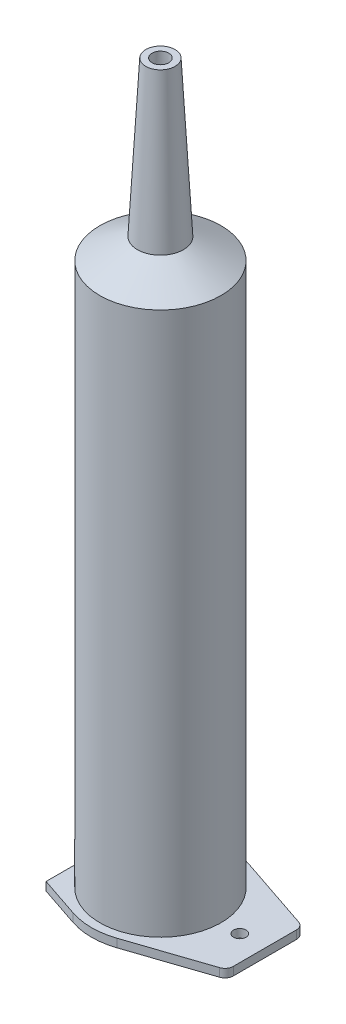
ISO-10303-21;
HEADER;
FILE_DESCRIPTION(('STEP AP214'),'2;1');
FILE_NAME('part.step','',(''),(''),'','','');
FILE_SCHEMA(('AUTOMOTIVE_DESIGN { 1 0 10303 214 1 1 1 1 }'));
ENDSEC;
DATA;
#1=APPLICATION_CONTEXT('core data for automotive mechanical design processes');
#2=APPLICATION_PROTOCOL_DEFINITION('international standard','automotive_design',2000,#1);
#3=PRODUCT_CONTEXT('',#1,'mechanical');
#4=PRODUCT('Part','Part','',(#3));
#5=PRODUCT_RELATED_PRODUCT_CATEGORY('part','',(#4));
#6=PRODUCT_DEFINITION_FORMATION('','',#4);
#7=PRODUCT_DEFINITION_CONTEXT('part definition',#1,'design');
#8=PRODUCT_DEFINITION('design','',#6,#7);
#9=PRODUCT_DEFINITION_SHAPE('','',#8);
#10=(LENGTH_UNIT() NAMED_UNIT(*) SI_UNIT(.MILLI.,.METRE.));
#11=(NAMED_UNIT(*) PLANE_ANGLE_UNIT() SI_UNIT($,.RADIAN.));
#12=(NAMED_UNIT(*) SI_UNIT($,.STERADIAN.) SOLID_ANGLE_UNIT());
#13=UNCERTAINTY_MEASURE_WITH_UNIT(LENGTH_MEASURE(1.E-05),#10,'distance_accuracy_value','');
#14=(GEOMETRIC_REPRESENTATION_CONTEXT(3) GLOBAL_UNCERTAINTY_ASSIGNED_CONTEXT((#13)) GLOBAL_UNIT_ASSIGNED_CONTEXT((#10,
#11,#12)) REPRESENTATION_CONTEXT('',''));
#15=CARTESIAN_POINT('',(0.,0.,0.));
#16=DIRECTION('',(0.,0.,1.));
#17=DIRECTION('',(1.,0.,0.));
#18=AXIS2_PLACEMENT_3D('',#15,#16,#17);
#19=CARTESIAN_POINT('',(0.,132.,0.));
#20=DIRECTION('',(0.,-1.,0.));
#21=DIRECTION('',(0.,0.,-1.));
#22=AXIS2_PLACEMENT_3D('',#19,#20,#21);
#23=CYLINDRICAL_SURFACE('',#22,14.5);
#24=CARTESIAN_POINT('',(0.,132.,0.));
#25=DIRECTION('',(0.,1.,0.));
#26=DIRECTION('',(0.,0.,1.));
#27=AXIS2_PLACEMENT_3D('',#24,#25,#26);
#28=CIRCLE('',#27,14.5);
#29=CARTESIAN_POINT('',(0.,132.,14.5));
#30=VERTEX_POINT('',#29);
#31=EDGE_CURVE('E188',#30,#30,#28,.T.);
#32=ORIENTED_EDGE('',*,*,#31,.F.);
#33=EDGE_LOOP('',(#32));
#34=FACE_BOUND('',#33,.T.);
#35=CARTESIAN_POINT('',(0.,2.,0.));
#36=DIRECTION('',(0.,-1.,0.));
#37=DIRECTION('',(0.,0.,-1.));
#38=AXIS2_PLACEMENT_3D('',#35,#36,#37);
#39=CIRCLE('',#38,14.5);
#40=CARTESIAN_POINT('',(0.,2.,-14.5));
#41=VERTEX_POINT('',#40);
#42=EDGE_CURVE('E191',#41,#41,#39,.T.);
#43=ORIENTED_EDGE('',*,*,#42,.F.);
#44=EDGE_LOOP('',(#43));
#45=FACE_BOUND('',#44,.T.);
#46=ADVANCED_FACE('F66',(#34,#45),#23,.T.);
#47=CARTESIAN_POINT('',(0.,0.,0.));
#48=DIRECTION('',(0.,1.,0.));
#49=DIRECTION('',(0.,0.,1.));
#50=AXIS2_PLACEMENT_3D('',#47,#48,#49);
#51=PLANE('',#50);
#52=CARTESIAN_POINT('',(19.,0.,0.));
#53=DIRECTION('',(0.,-1.,0.));
#54=DIRECTION('',(0.,0.,-1.));
#55=AXIS2_PLACEMENT_3D('',#52,#53,#54);
#56=CIRCLE('',#55,1.5);
#57=CARTESIAN_POINT('',(19.,0.,-1.5));
#58=VERTEX_POINT('',#57);
#59=EDGE_CURVE('E212',#58,#58,#56,.T.);
#60=ORIENTED_EDGE('',*,*,#59,.F.);
#61=EDGE_LOOP('',(#60));
#62=FACE_BOUND('',#61,.T.);
#63=CARTESIAN_POINT('',(0.,0.,0.));
#64=DIRECTION('',(0.,1.,0.));
#65=DIRECTION('',(0.,0.,1.));
#66=AXIS2_PLACEMENT_3D('',#63,#64,#65);
#67=CIRCLE('',#66,13.);
#68=CARTESIAN_POINT('',(0.,0.,13.));
#69=VERTEX_POINT('',#68);
#70=EDGE_CURVE('E178',#69,#69,#67,.T.);
#71=ORIENTED_EDGE('',*,*,#70,.T.);
#72=EDGE_LOOP('',(#71));
#73=FACE_BOUND('',#72,.T.);
#74=DIRECTION('',(-0.947828101970911,0.,-0.318781883290472));
#75=VECTOR('',#74,1.);
#76=CARTESIAN_POINT('',(-25.,0.,9.));
#77=LINE('',#76,#75);
#78=CARTESIAN_POINT('',(-5.25990107429279,0.,15.63916368252));
#79=VERTEX_POINT('',#78);
#80=CARTESIAN_POINT('',(-15.,0.,12.3632879488126));
#81=VERTEX_POINT('',#80);
#82=EDGE_CURVE('E161',#79,#81,#77,.T.);
#83=ORIENTED_EDGE('',*,*,#82,.T.);
#84=DIRECTION('',(0.,0.,1.));
#85=VECTOR('',#84,1.);
#86=CARTESIAN_POINT('',(-15.,0.,12.3632879488126));
#87=LINE('',#86,#85);
#88=CARTESIAN_POINT('',(-15.,0.,-12.3632879488126));
#89=VERTEX_POINT('',#88);
#90=EDGE_CURVE('E148',#89,#81,#87,.T.);
#91=ORIENTED_EDGE('',*,*,#90,.F.);
#92=DIRECTION('',(0.947828101970911,0.,-0.318781883290472));
#93=VECTOR('',#92,1.);
#94=CARTESIAN_POINT('',(-25.,0.,-9.));
#95=LINE('',#94,#93);
#96=CARTESIAN_POINT('',(-5.25990107429278,0.,-15.63916368252));
#97=VERTEX_POINT('',#96);
#98=EDGE_CURVE('E157',#89,#97,#95,.T.);
#99=ORIENTED_EDGE('',*,*,#98,.T.);
#100=CARTESIAN_POINT('',(0.,0.,0.));
#101=DIRECTION('',(0.,-1.,0.));
#102=DIRECTION('',(0.,0.,-1.));
#103=AXIS2_PLACEMENT_3D('',#100,#101,#102);
#104=CIRCLE('',#103,16.5);
#105=CARTESIAN_POINT('',(5.25990107429279,0.,-15.63916368252));
#106=VERTEX_POINT('',#105);
#107=EDGE_CURVE('E168',#97,#106,#104,.T.);
#108=ORIENTED_EDGE('',*,*,#107,.T.);
#109=DIRECTION('',(0.947828101970911,0.,0.318781883290472));
#110=VECTOR('',#109,1.);
#111=CARTESIAN_POINT('',(25.,0.,-9.));
#112=LINE('',#111,#110);
#113=CARTESIAN_POINT('',(23.6375637665809,0.,-9.4582265364884));
#114=VERTEX_POINT('',#113);
#115=EDGE_CURVE('E311',#106,#114,#112,.T.);
#116=ORIENTED_EDGE('',*,*,#115,.T.);
#117=CARTESIAN_POINT('',(23.,0.,-7.56257033254658));
#118=DIRECTION('',(0.,1.,0.));
#119=DIRECTION('',(0.,0.,1.));
#120=AXIS2_PLACEMENT_3D('',#117,#118,#119);
#121=CIRCLE('',#120,2.);
#122=CARTESIAN_POINT('',(25.,0.,-7.56257033254658));
#123=VERTEX_POINT('',#122);
#124=EDGE_CURVE('E194',#114,#123,#121,.F.);
#125=ORIENTED_EDGE('',*,*,#124,.T.);
#126=DIRECTION('',(0.,0.,1.));
#127=VECTOR('',#126,1.);
#128=CARTESIAN_POINT('',(25.,0.,-9.));
#129=LINE('',#128,#127);
#130=CARTESIAN_POINT('',(25.,0.,7.56257033254658));
#131=VERTEX_POINT('',#130);
#132=EDGE_CURVE('E305',#123,#131,#129,.T.);
#133=ORIENTED_EDGE('',*,*,#132,.T.);
#134=CARTESIAN_POINT('',(23.,0.,7.56257033254658));
#135=DIRECTION('',(0.,1.,0.));
#136=DIRECTION('',(0.,0.,1.));
#137=AXIS2_PLACEMENT_3D('',#134,#135,#136);
#138=CIRCLE('',#137,2.);
#139=CARTESIAN_POINT('',(23.6375637665809,0.,9.4582265364884));
#140=VERTEX_POINT('',#139);
#141=EDGE_CURVE('E196',#131,#140,#138,.F.);
#142=ORIENTED_EDGE('',*,*,#141,.T.);
#143=DIRECTION('',(-0.947828101970911,0.,0.318781883290472));
#144=VECTOR('',#143,1.);
#145=CARTESIAN_POINT('',(25.,0.,9.));
#146=LINE('',#145,#144);
#147=CARTESIAN_POINT('',(5.25990107429279,0.,15.63916368252));
#148=VERTEX_POINT('',#147);
#149=EDGE_CURVE('E310',#140,#148,#146,.T.);
#150=ORIENTED_EDGE('',*,*,#149,.T.);
#151=CARTESIAN_POINT('',(0.,0.,0.));
#152=DIRECTION('',(0.,-1.,0.));
#153=DIRECTION('',(0.,0.,-1.));
#154=AXIS2_PLACEMENT_3D('',#151,#152,#153);
#155=CIRCLE('',#154,16.5);
#156=EDGE_CURVE('E172',#148,#79,#155,.T.);
#157=ORIENTED_EDGE('',*,*,#156,.T.);
#158=EDGE_LOOP('',(#83,#91,#99,#108,#116,#125,#133,#142,#150,#157));
#159=FACE_BOUND('',#158,.T.);
#160=ADVANCED_FACE('F155',(#62,#73,#159),#51,.F.);
#161=CARTESIAN_POINT('',(0.,132.,0.));
#162=DIRECTION('',(0.,-1.,0.));
#163=DIRECTION('',(0.,0.,-1.));
#164=AXIS2_PLACEMENT_3D('',#161,#162,#163);
#165=CYLINDRICAL_SURFACE('',#164,13.);
#166=CARTESIAN_POINT('',(0.,132.,0.));
#167=DIRECTION('',(0.,-1.,0.));
#168=DIRECTION('',(0.,0.,-1.));
#169=AXIS2_PLACEMENT_3D('',#166,#167,#168);
#170=CIRCLE('',#169,13.);
#171=CARTESIAN_POINT('',(0.,132.,-13.));
#172=VERTEX_POINT('',#171);
#173=EDGE_CURVE('E343',#172,#172,#170,.T.);
#174=ORIENTED_EDGE('',*,*,#173,.F.);
#175=EDGE_LOOP('',(#174));
#176=FACE_BOUND('',#175,.T.);
#177=ORIENTED_EDGE('',*,*,#70,.F.);
#178=EDGE_LOOP('',(#177));
#179=FACE_BOUND('',#178,.T.);
#180=ADVANCED_FACE('F285',(#176,#179),#165,.F.);
#181=CARTESIAN_POINT('',(25.,2.,-9.));
#182=DIRECTION('',(0.318781883290472,0.,-0.947828101970911));
#183=DIRECTION('',(-0.947828101970911,0.,-0.318781883290472));
#184=AXIS2_PLACEMENT_3D('',#181,#182,#183);
#185=PLANE('',#184);
#186=DIRECTION('',(0.947828101970911,0.,0.318781883290472));
#187=VECTOR('',#186,1.);
#188=CARTESIAN_POINT('',(25.,2.,-9.));
#189=LINE('',#188,#187);
#190=CARTESIAN_POINT('',(5.25990107429279,2.,-15.63916368252));
#191=VERTEX_POINT('',#190);
#192=CARTESIAN_POINT('',(23.6375637665809,2.,-9.4582265364884));
#193=VERTEX_POINT('',#192);
#194=EDGE_CURVE('E170',#191,#193,#189,.T.);
#195=ORIENTED_EDGE('',*,*,#194,.T.);
#196=DIRECTION('',(0.,-1.,0.));
#197=VECTOR('',#196,1.);
#198=CARTESIAN_POINT('',(23.6375637665809,2.,-9.4582265364884));
#199=LINE('',#198,#197);
#200=EDGE_CURVE('E76',#193,#114,#199,.T.);
#201=ORIENTED_EDGE('',*,*,#200,.T.);
#202=ORIENTED_EDGE('',*,*,#115,.F.);
#203=DIRECTION('',(0.,-1.,0.));
#204=VECTOR('',#203,1.);
#205=CARTESIAN_POINT('',(5.25990107429279,2.,-15.63916368252));
#206=LINE('',#205,#204);
#207=EDGE_CURVE('E176',#191,#106,#206,.T.);
#208=ORIENTED_EDGE('',*,*,#207,.F.);
#209=EDGE_LOOP('',(#195,#201,#202,#208));
#210=FACE_BOUND('',#209,.T.);
#211=ADVANCED_FACE('F264',(#210),#185,.T.);
#212=CARTESIAN_POINT('',(0.,2.,0.));
#213=DIRECTION('',(0.,-1.,0.));
#214=DIRECTION('',(0.,0.,-1.));
#215=AXIS2_PLACEMENT_3D('',#212,#213,#214);
#216=CYLINDRICAL_SURFACE('',#215,16.5);
#217=ORIENTED_EDGE('',*,*,#107,.F.);
#218=DIRECTION('',(0.,-1.,0.));
#219=VECTOR('',#218,1.);
#220=CARTESIAN_POINT('',(-5.25990107429278,2.,-15.63916368252));
#221=LINE('',#220,#219);
#222=CARTESIAN_POINT('',(-5.25990107429278,2.,-15.63916368252));
#223=VERTEX_POINT('',#222);
#224=EDGE_CURVE('E166',#223,#97,#221,.T.);
#225=ORIENTED_EDGE('',*,*,#224,.F.);
#226=CARTESIAN_POINT('',(0.,2.,0.));
#227=DIRECTION('',(0.,-1.,0.));
#228=DIRECTION('',(0.,0.,-1.));
#229=AXIS2_PLACEMENT_3D('',#226,#227,#228);
#230=CIRCLE('',#229,16.5);
#231=EDGE_CURVE('E185',#223,#191,#230,.T.);
#232=ORIENTED_EDGE('',*,*,#231,.T.);
#233=ORIENTED_EDGE('',*,*,#207,.T.);
#234=EDGE_LOOP('',(#217,#225,#232,#233));
#235=FACE_BOUND('',#234,.T.);
#236=ADVANCED_FACE('F261',(#235),#216,.T.);
#237=CARTESIAN_POINT('',(-25.,2.,-9.));
#238=DIRECTION('',(-0.318781883290472,0.,-0.947828101970911));
#239=DIRECTION('',(-0.947828101970911,0.,0.318781883290472));
#240=AXIS2_PLACEMENT_3D('',#237,#238,#239);
#241=PLANE('',#240);
#242=DIRECTION('',(0.,-1.,0.));
#243=VECTOR('',#242,1.);
#244=CARTESIAN_POINT('',(-15.,10.,-12.3632879488126));
#245=LINE('',#244,#243);
#246=CARTESIAN_POINT('',(-15.,2.,-12.3632879488126));
#247=VERTEX_POINT('',#246);
#248=EDGE_CURVE('E145',#247,#89,#245,.T.);
#249=ORIENTED_EDGE('',*,*,#248,.F.);
#250=DIRECTION('',(0.947828101970911,0.,-0.318781883290472));
#251=VECTOR('',#250,1.);
#252=CARTESIAN_POINT('',(-25.,2.,-9.));
#253=LINE('',#252,#251);
#254=EDGE_CURVE('E334',#247,#223,#253,.T.);
#255=ORIENTED_EDGE('',*,*,#254,.T.);
#256=ORIENTED_EDGE('',*,*,#224,.T.);
#257=ORIENTED_EDGE('',*,*,#98,.F.);
#258=EDGE_LOOP('',(#249,#255,#256,#257));
#259=FACE_BOUND('',#258,.T.);
#260=ADVANCED_FACE('F164',(#259),#241,.T.);
#261=CARTESIAN_POINT('',(-25.,2.,9.));
#262=DIRECTION('',(-0.318781883290472,0.,0.947828101970911));
#263=DIRECTION('',(0.947828101970911,0.,0.318781883290472));
#264=AXIS2_PLACEMENT_3D('',#261,#262,#263);
#265=PLANE('',#264);
#266=DIRECTION('',(0.,-1.,0.));
#267=VECTOR('',#266,1.);
#268=CARTESIAN_POINT('',(-15.,10.,12.3632879488126));
#269=LINE('',#268,#267);
#270=CARTESIAN_POINT('',(-15.,2.,12.3632879488126));
#271=VERTEX_POINT('',#270);
#272=EDGE_CURVE('E84',#271,#81,#269,.T.);
#273=ORIENTED_EDGE('',*,*,#272,.T.);
#274=ORIENTED_EDGE('',*,*,#82,.F.);
#275=DIRECTION('',(0.,-1.,0.));
#276=VECTOR('',#275,1.);
#277=CARTESIAN_POINT('',(-5.25990107429279,2.,15.63916368252));
#278=LINE('',#277,#276);
#279=CARTESIAN_POINT('',(-5.25990107429279,2.,15.63916368252));
#280=VERTEX_POINT('',#279);
#281=EDGE_CURVE('E180',#280,#79,#278,.T.);
#282=ORIENTED_EDGE('',*,*,#281,.F.);
#283=DIRECTION('',(-0.947828101970911,0.,-0.318781883290472));
#284=VECTOR('',#283,1.);
#285=CARTESIAN_POINT('',(-25.,2.,9.));
#286=LINE('',#285,#284);
#287=EDGE_CURVE('E323',#280,#271,#286,.T.);
#288=ORIENTED_EDGE('',*,*,#287,.T.);
#289=EDGE_LOOP('',(#273,#274,#282,#288));
#290=FACE_BOUND('',#289,.T.);
#291=ADVANCED_FACE('F268',(#290),#265,.T.);
#292=CARTESIAN_POINT('',(0.,2.,0.));
#293=DIRECTION('',(0.,-1.,0.));
#294=DIRECTION('',(0.,0.,-1.));
#295=AXIS2_PLACEMENT_3D('',#292,#293,#294);
#296=CYLINDRICAL_SURFACE('',#295,16.5);
#297=ORIENTED_EDGE('',*,*,#156,.F.);
#298=DIRECTION('',(0.,-1.,0.));
#299=VECTOR('',#298,1.);
#300=CARTESIAN_POINT('',(5.25990107429279,2.,15.63916368252));
#301=LINE('',#300,#299);
#302=CARTESIAN_POINT('',(5.25990107429279,2.,15.63916368252));
#303=VERTEX_POINT('',#302);
#304=EDGE_CURVE('E182',#303,#148,#301,.T.);
#305=ORIENTED_EDGE('',*,*,#304,.F.);
#306=CARTESIAN_POINT('',(0.,2.,0.));
#307=DIRECTION('',(0.,-1.,0.));
#308=DIRECTION('',(0.,0.,-1.));
#309=AXIS2_PLACEMENT_3D('',#306,#307,#308);
#310=CIRCLE('',#309,16.5);
#311=EDGE_CURVE('E320',#303,#280,#310,.T.);
#312=ORIENTED_EDGE('',*,*,#311,.T.);
#313=ORIENTED_EDGE('',*,*,#281,.T.);
#314=EDGE_LOOP('',(#297,#305,#312,#313));
#315=FACE_BOUND('',#314,.T.);
#316=ADVANCED_FACE('F271',(#315),#296,.T.);
#317=CARTESIAN_POINT('',(25.,2.,9.));
#318=DIRECTION('',(0.318781883290472,0.,0.947828101970911));
#319=DIRECTION('',(0.947828101970911,0.,-0.318781883290472));
#320=AXIS2_PLACEMENT_3D('',#317,#318,#319);
#321=PLANE('',#320);
#322=ORIENTED_EDGE('',*,*,#149,.F.);
#323=DIRECTION('',(0.,-1.,0.));
#324=VECTOR('',#323,1.);
#325=CARTESIAN_POINT('',(23.6375637665809,2.,9.4582265364884));
#326=LINE('',#325,#324);
#327=CARTESIAN_POINT('',(23.6375637665809,2.,9.4582265364884));
#328=VERTEX_POINT('',#327);
#329=EDGE_CURVE('E206',#140,#328,#326,.F.);
#330=ORIENTED_EDGE('',*,*,#329,.T.);
#331=DIRECTION('',(-0.947828101970911,0.,0.318781883290472));
#332=VECTOR('',#331,1.);
#333=CARTESIAN_POINT('',(25.,2.,9.));
#334=LINE('',#333,#332);
#335=EDGE_CURVE('E330',#328,#303,#334,.T.);
#336=ORIENTED_EDGE('',*,*,#335,.T.);
#337=ORIENTED_EDGE('',*,*,#304,.T.);
#338=EDGE_LOOP('',(#322,#330,#336,#337));
#339=FACE_BOUND('',#338,.T.);
#340=ADVANCED_FACE('F275',(#339),#321,.T.);
#341=CARTESIAN_POINT('',(25.,2.,-9.));
#342=DIRECTION('',(1.,0.,0.));
#343=DIRECTION('',(0.,0.,-1.));
#344=AXIS2_PLACEMENT_3D('',#341,#342,#343);
#345=PLANE('',#344);
#346=DIRECTION('',(0.,0.,1.));
#347=VECTOR('',#346,1.);
#348=CARTESIAN_POINT('',(25.,2.,-9.));
#349=LINE('',#348,#347);
#350=CARTESIAN_POINT('',(25.,2.,-7.56257033254658));
#351=VERTEX_POINT('',#350);
#352=CARTESIAN_POINT('',(25.,2.,7.56257033254658));
#353=VERTEX_POINT('',#352);
#354=EDGE_CURVE('E307',#351,#353,#349,.T.);
#355=ORIENTED_EDGE('',*,*,#354,.T.);
#356=DIRECTION('',(0.,-1.,0.));
#357=VECTOR('',#356,1.);
#358=CARTESIAN_POINT('',(25.,2.,7.56257033254658));
#359=LINE('',#358,#357);
#360=EDGE_CURVE('E203',#353,#131,#359,.T.);
#361=ORIENTED_EDGE('',*,*,#360,.T.);
#362=ORIENTED_EDGE('',*,*,#132,.F.);
#363=DIRECTION('',(0.,-1.,0.));
#364=VECTOR('',#363,1.);
#365=CARTESIAN_POINT('',(25.,2.,-7.56257033254658));
#366=LINE('',#365,#364);
#367=EDGE_CURVE('E201',#123,#351,#366,.F.);
#368=ORIENTED_EDGE('',*,*,#367,.T.);
#369=EDGE_LOOP('',(#355,#361,#362,#368));
#370=FACE_BOUND('',#369,.T.);
#371=ADVANCED_FACE('F259',(#370),#345,.T.);
#372=CARTESIAN_POINT('',(0.,2.,0.));
#373=DIRECTION('',(0.,-1.,0.));
#374=DIRECTION('',(0.,0.,-1.));
#375=AXIS2_PLACEMENT_3D('',#372,#373,#374);
#376=PLANE('',#375);
#377=CARTESIAN_POINT('',(19.,2.,0.));
#378=DIRECTION('',(0.,-1.,0.));
#379=DIRECTION('',(0.,0.,-1.));
#380=AXIS2_PLACEMENT_3D('',#377,#378,#379);
#381=CIRCLE('',#380,1.5);
#382=CARTESIAN_POINT('',(19.,2.,-1.5));
#383=VERTEX_POINT('',#382);
#384=EDGE_CURVE('E162',#383,#383,#381,.T.);
#385=ORIENTED_EDGE('',*,*,#384,.T.);
#386=EDGE_LOOP('',(#385));
#387=FACE_BOUND('',#386,.T.);
#388=ORIENTED_EDGE('',*,*,#42,.T.);
#389=EDGE_LOOP('',(#388));
#390=FACE_BOUND('',#389,.T.);
#391=ORIENTED_EDGE('',*,*,#254,.F.);
#392=DIRECTION('',(0.,0.,1.));
#393=VECTOR('',#392,1.);
#394=CARTESIAN_POINT('',(-15.,2.,0.));
#395=LINE('',#394,#393);
#396=EDGE_CURVE('E13',#247,#271,#395,.T.);
#397=ORIENTED_EDGE('',*,*,#396,.T.);
#398=ORIENTED_EDGE('',*,*,#287,.F.);
#399=ORIENTED_EDGE('',*,*,#311,.F.);
#400=ORIENTED_EDGE('',*,*,#335,.F.);
#401=CARTESIAN_POINT('',(23.,2.,7.56257033254658));
#402=DIRECTION('',(0.,-1.,0.));
#403=DIRECTION('',(0.,0.,-1.));
#404=AXIS2_PLACEMENT_3D('',#401,#402,#403);
#405=CIRCLE('',#404,2.);
#406=EDGE_CURVE('E91',#328,#353,#405,.F.);
#407=ORIENTED_EDGE('',*,*,#406,.T.);
#408=ORIENTED_EDGE('',*,*,#354,.F.);
#409=CARTESIAN_POINT('',(23.,2.,-7.56257033254658));
#410=DIRECTION('',(0.,-1.,0.));
#411=DIRECTION('',(0.,0.,-1.));
#412=AXIS2_PLACEMENT_3D('',#409,#410,#411);
#413=CIRCLE('',#412,2.);
#414=EDGE_CURVE('E198',#351,#193,#413,.F.);
#415=ORIENTED_EDGE('',*,*,#414,.T.);
#416=ORIENTED_EDGE('',*,*,#194,.F.);
#417=ORIENTED_EDGE('',*,*,#231,.F.);
#418=EDGE_LOOP('',(#391,#397,#398,#399,#400,#407,#408,#415,#416,#417));
#419=FACE_BOUND('',#418,.T.);
#420=ADVANCED_FACE('F255',(#387,#390,#419),#376,.F.);
#421=CARTESIAN_POINT('',(23.,2.,7.56257033254658));
#422=DIRECTION('',(0.,-1.,0.));
#423=DIRECTION('',(0.,0.,-1.));
#424=AXIS2_PLACEMENT_3D('',#421,#422,#423);
#425=CYLINDRICAL_SURFACE('',#424,2.);
#426=ORIENTED_EDGE('',*,*,#406,.F.);
#427=ORIENTED_EDGE('',*,*,#329,.F.);
#428=ORIENTED_EDGE('',*,*,#141,.F.);
#429=ORIENTED_EDGE('',*,*,#360,.F.);
#430=EDGE_LOOP('',(#426,#427,#428,#429));
#431=FACE_BOUND('',#430,.T.);
#432=ADVANCED_FACE('F258',(#431),#425,.T.);
#433=CARTESIAN_POINT('',(23.,2.,-7.56257033254658));
#434=DIRECTION('',(0.,-1.,0.));
#435=DIRECTION('',(0.,0.,-1.));
#436=AXIS2_PLACEMENT_3D('',#433,#434,#435);
#437=CYLINDRICAL_SURFACE('',#436,2.);
#438=ORIENTED_EDGE('',*,*,#414,.F.);
#439=ORIENTED_EDGE('',*,*,#367,.F.);
#440=ORIENTED_EDGE('',*,*,#124,.F.);
#441=ORIENTED_EDGE('',*,*,#200,.F.);
#442=EDGE_LOOP('',(#438,#439,#440,#441));
#443=FACE_BOUND('',#442,.T.);
#444=ADVANCED_FACE('F68',(#443),#437,.T.);
#445=CARTESIAN_POINT('',(-15.,10.,12.3632879488126));
#446=DIRECTION('',(1.,0.,0.));
#447=DIRECTION('',(0.,0.,-1.));
#448=AXIS2_PLACEMENT_3D('',#445,#446,#447);
#449=PLANE('',#448);
#450=ORIENTED_EDGE('',*,*,#248,.T.);
#451=ORIENTED_EDGE('',*,*,#90,.T.);
#452=ORIENTED_EDGE('',*,*,#272,.F.);
#453=ORIENTED_EDGE('',*,*,#396,.F.);
#454=EDGE_LOOP('',(#450,#451,#452,#453));
#455=FACE_BOUND('',#454,.T.);
#456=ADVANCED_FACE('F147',(#455),#449,.F.);
#457=CARTESIAN_POINT('',(19.,10.,0.));
#458=DIRECTION('',(0.,-1.,0.));
#459=DIRECTION('',(0.,0.,-1.));
#460=AXIS2_PLACEMENT_3D('',#457,#458,#459);
#461=CYLINDRICAL_SURFACE('',#460,1.5);
#462=ORIENTED_EDGE('',*,*,#59,.T.);
#463=EDGE_LOOP('',(#462));
#464=FACE_BOUND('',#463,.T.);
#465=ORIENTED_EDGE('',*,*,#384,.F.);
#466=EDGE_LOOP('',(#465));
#467=FACE_BOUND('',#466,.T.);
#468=ADVANCED_FACE('F241',(#464,#467),#461,.F.);
#469=CARTESIAN_POINT('',(0.,132.,0.));
#470=DIRECTION('',(0.,-1.,0.));
#471=DIRECTION('',(0.,0.,-1.));
#472=AXIS2_PLACEMENT_3D('',#469,#470,#471);
#473=CONICAL_SURFACE('',#472,13.,1.06369782240256);
#474=CARTESIAN_POINT('',(0.,137.,0.));
#475=DIRECTION('',(0.,-1.,0.));
#476=DIRECTION('',(0.,0.,-1.));
#477=AXIS2_PLACEMENT_3D('',#474,#475,#476);
#478=CIRCLE('',#477,4.);
#479=CARTESIAN_POINT('',(0.,137.,-3.99999999999998));
#480=VERTEX_POINT('',#479);
#481=EDGE_CURVE('E70',#480,#480,#478,.T.);
#482=CARTESIAN_POINT('',(0.,137.,-3.99999999999998));
#483=CARTESIAN_POINT('',(0.,136.947916666667,-4.09374999999998));
#484=CARTESIAN_POINT('',(0.,136.895833333333,-4.18749999999998));
#485=CARTESIAN_POINT('',(0.,136.791666666667,-4.37499999999998));
#486=CARTESIAN_POINT('',(0.,136.739583333333,-4.46874999999998));
#487=CARTESIAN_POINT('',(0.,136.635416666667,-4.65624999999998));
#488=CARTESIAN_POINT('',(0.,136.583333333333,-4.74999999999998));
#489=CARTESIAN_POINT('',(0.,136.479166666667,-4.93749999999998));
#490=CARTESIAN_POINT('',(0.,136.427083333333,-5.03124999999998));
#491=CARTESIAN_POINT('',(0.,136.322916666667,-5.21874999999998));
#492=CARTESIAN_POINT('',(0.,136.270833333333,-5.31249999999998));
#493=CARTESIAN_POINT('',(0.,136.166666666667,-5.49999999999998));
#494=CARTESIAN_POINT('',(0.,136.114583333333,-5.59374999999998));
#495=CARTESIAN_POINT('',(0.,136.010416666667,-5.78124999999998));
#496=CARTESIAN_POINT('',(0.,135.958333333333,-5.87499999999998));
#497=CARTESIAN_POINT('',(0.,135.854166666667,-6.06249999999998));
#498=CARTESIAN_POINT('',(0.,135.802083333333,-6.15624999999998));
#499=CARTESIAN_POINT('',(0.,135.697916666667,-6.34374999999998));
#500=CARTESIAN_POINT('',(0.,135.645833333333,-6.43749999999998));
#501=CARTESIAN_POINT('',(0.,135.541666666667,-6.62499999999997));
#502=CARTESIAN_POINT('',(0.,135.489583333333,-6.71874999999998));
#503=CARTESIAN_POINT('',(0.,135.385416666667,-6.90624999999998));
#504=CARTESIAN_POINT('',(0.,135.333333333333,-6.99999999999998));
#505=CARTESIAN_POINT('',(0.,135.229166666667,-7.18749999999998));
#506=CARTESIAN_POINT('',(0.,135.177083333333,-7.28124999999998));
#507=CARTESIAN_POINT('',(0.,135.072916666667,-7.46874999999998));
#508=CARTESIAN_POINT('',(0.,135.020833333333,-7.56249999999998));
#509=CARTESIAN_POINT('',(0.,134.916666666667,-7.74999999999998));
#510=CARTESIAN_POINT('',(0.,134.864583333333,-7.84374999999998));
#511=CARTESIAN_POINT('',(0.,134.760416666667,-8.03124999999998));
#512=CARTESIAN_POINT('',(0.,134.708333333333,-8.12499999999998));
#513=CARTESIAN_POINT('',(0.,134.604166666667,-8.31249999999998));
#514=CARTESIAN_POINT('',(0.,134.552083333333,-8.40624999999998));
#515=CARTESIAN_POINT('',(0.,134.447916666667,-8.59374999999998));
#516=CARTESIAN_POINT('',(0.,134.395833333333,-8.68749999999998));
#517=CARTESIAN_POINT('',(0.,134.291666666667,-8.87499999999998));
#518=CARTESIAN_POINT('',(0.,134.239583333333,-8.96874999999998));
#519=CARTESIAN_POINT('',(0.,134.135416666667,-9.15624999999998));
#520=CARTESIAN_POINT('',(0.,134.083333333333,-9.24999999999998));
#521=CARTESIAN_POINT('',(0.,133.979166666667,-9.43749999999998));
#522=CARTESIAN_POINT('',(0.,133.927083333333,-9.53124999999998));
#523=CARTESIAN_POINT('',(0.,133.822916666667,-9.71874999999998));
#524=CARTESIAN_POINT('',(0.,133.770833333333,-9.81249999999998));
#525=CARTESIAN_POINT('',(0.,133.666666666667,-9.99999999999998));
#526=CARTESIAN_POINT('',(0.,133.614583333333,-10.09375));
#527=CARTESIAN_POINT('',(0.,133.510416666667,-10.28125));
#528=CARTESIAN_POINT('',(0.,133.458333333333,-10.375));
#529=CARTESIAN_POINT('',(0.,133.354166666667,-10.5625));
#530=CARTESIAN_POINT('',(0.,133.302083333333,-10.65625));
#531=CARTESIAN_POINT('',(0.,133.197916666667,-10.84375));
#532=CARTESIAN_POINT('',(0.,133.145833333333,-10.9375));
#533=CARTESIAN_POINT('',(0.,133.041666666667,-11.125));
#534=CARTESIAN_POINT('',(0.,132.989583333333,-11.21875));
#535=CARTESIAN_POINT('',(0.,132.885416666667,-11.40625));
#536=CARTESIAN_POINT('',(0.,132.833333333333,-11.5));
#537=CARTESIAN_POINT('',(0.,132.729166666667,-11.6875));
#538=CARTESIAN_POINT('',(0.,132.677083333333,-11.78125));
#539=CARTESIAN_POINT('',(0.,132.572916666667,-11.96875));
#540=CARTESIAN_POINT('',(0.,132.520833333333,-12.0625));
#541=CARTESIAN_POINT('',(0.,132.416666666667,-12.25));
#542=CARTESIAN_POINT('',(0.,132.364583333333,-12.34375));
#543=CARTESIAN_POINT('',(0.,132.260416666667,-12.53125));
#544=CARTESIAN_POINT('',(0.,132.208333333333,-12.625));
#545=CARTESIAN_POINT('',(0.,132.104166666667,-12.8125));
#546=CARTESIAN_POINT('',(0.,132.052083333333,-12.90625));
#547=CARTESIAN_POINT('',(0.,132.,-13.));
#548=B_SPLINE_CURVE_WITH_KNOTS('',3,(#482,#483,#484,#485,#486,#487,#488,#489,#490,#491,#492,
#493,#494,#495,#496,#497,#498,#499,#500,#501,#502,#503,#504,#505,#506,#507,#508,#509,#510,#511,
#512,#513,#514,#515,#516,#517,#518,#519,#520,#521,#522,#523,#524,#525,#526,#527,#528,#529,#530,
#531,#532,#533,#534,#535,#536,#537,#538,#539,#540,#541,#542,#543,#544,#545,#546,#547),
.UNSPECIFIED.,.F.,.F.,(4,2,2,2,2,2,2,2,2,2,2,2,2,2,2,2,2,2,2,2,2,2,2,2,2,2,2,2,2,2,2,2,4),(0.,
0.321738441905841,0.643476883811683,0.965215325717525,1.28695376762337,1.60869220952921,
1.93043065143505,2.25216909334089,2.57390753524674,2.89564597715259,3.21738441905843,
3.53912286096428,3.86086130287012,4.18259974477596,4.5043381866818,4.82607662858764,
5.1478150704935,5.46955351239934,5.79129195430518,6.11303039621103,6.43476883811687,
6.75650728002271,7.07824572192855,7.39998416383439,7.72172260574024,8.04346104764609,
8.36519948955193,8.68693793145777,9.00867637336362,9.33041481526946,9.6521532571753,
9.97389169908114,10.295630140987),.UNSPECIFIED.);
#549=EDGE_CURVE('BSEAM235',#480,#172,#548,.T.);
#550=ORIENTED_EDGE('',*,*,#481,.F.);
#551=ORIENTED_EDGE('',*,*,#173,.T.);
#552=ORIENTED_EDGE('',*,*,#549,.T.);
#553=ORIENTED_EDGE('',*,*,#549,.F.);
#554=EDGE_LOOP('',(#550,#552,#551,#553));
#555=FACE_BOUND('',#554,.T.);
#556=ADVANCED_FACE('F235',(#555),#473,.F.);
#557=CARTESIAN_POINT('',(0.,132.,0.));
#558=DIRECTION('',(0.,-1.,0.));
#559=DIRECTION('',(0.,0.,-1.));
#560=AXIS2_PLACEMENT_3D('',#557,#558,#559);
#561=CONICAL_SURFACE('',#560,14.5,1.06369782240256);
#562=CARTESIAN_POINT('',(0.,137.,-5.5));
#563=CARTESIAN_POINT('',(0.154690555615609,136.999999685481,-5.50000159810853));
#564=CARTESIAN_POINT('',(0.309363263851578,136.999929656132,-5.49359795785267));
#565=CARTESIAN_POINT('',(0.617674951347975,136.999759874371,-5.46782964306846));
#566=CARTESIAN_POINT('',(0.771313697942811,136.999660115483,-5.44846214378605));
#567=CARTESIAN_POINT('',(1.07649193940787,136.999497537923,-5.39676600331129));
#568=CARTESIAN_POINT('',(1.22803007921668,136.999434742103,-5.36442936492464));
#569=CARTESIAN_POINT('',(1.52786144758684,136.999373738194,-5.28696728880239));
#570=CARTESIAN_POINT('',(1.67615348828179,136.999375553365,-5.24183725106529));
#571=CARTESIAN_POINT('',(1.9679860007574,136.999441494192,-5.13925599526249));
#572=CARTESIAN_POINT('',(2.11153763824318,136.999505460735,-5.08183653199771));
#573=CARTESIAN_POINT('',(2.39331952654567,136.99967374185,-4.95503388106408));
#574=CARTESIAN_POINT('',(2.53154775864005,136.999778071566,-4.88564620845238));
#575=CARTESIAN_POINT('',(2.80161721387959,136.99999602746,-4.73549183349792));
#576=CARTESIAN_POINT('',(2.93346053325941,137.000109650553,-4.65472890027845));
#577=CARTESIAN_POINT('',(3.18994946346175,137.000315200986,-4.48239463390791));
#578=CARTESIAN_POINT('',(3.31459250710575,137.000407120623,-4.39081948077062));
#579=CARTESIAN_POINT('',(3.55566454531819,137.000545299495,-4.19765274407583));
#580=CARTESIAN_POINT('',(3.67210117479907,137.000591601704,-4.09607068732131));
#581=CARTESIAN_POINT('',(3.89608983021499,137.000627043678,-3.88354279744073));
#582=CARTESIAN_POINT('',(4.00364184185786,137.00061618335,-3.77259694925227));
#583=CARTESIAN_POINT('',(4.20911692306947,137.000540010673,-3.5421014394151));
#584=CARTESIAN_POINT('',(4.3070390924756,137.000474693238,-3.42255097524372));
#585=CARTESIAN_POINT('',(4.4925028809326,137.000306207422,-3.17571693161175));
#586=CARTESIAN_POINT('',(4.5800481084802,137.00020305225,-3.04843606375941));
#587=CARTESIAN_POINT('',(4.74484097343871,136.999985101951,-2.78585862637793));
#588=CARTESIAN_POINT('',(4.82199471537267,136.999870215303,-2.65050309916225));
#589=CARTESIAN_POINT('',(4.96448441416864,136.999662351475,-2.37377170562099));
#590=CARTESIAN_POINT('',(5.02982481756936,136.999569366048,-2.23239812934635));
#591=CARTESIAN_POINT('',(5.14822210968943,136.999434370914,-1.9445404602606));
#592=CARTESIAN_POINT('',(5.20127484526026,136.999392378422,-1.79805465874552));
#593=CARTESIAN_POINT('',(5.2946350740035,136.999375645489,-1.5011370818277));
#594=CARTESIAN_POINT('',(5.33494740932249,136.999400879463,-1.35070682916023));
#595=CARTESIAN_POINT('',(5.40217129325423,136.999507806996,-1.04877338469353));
#596=CARTESIAN_POINT('',(5.42923745614353,136.999588821198,-0.897304583310809));
#597=CARTESIAN_POINT('',(5.47055386606833,136.999771217938,-0.592625921596037));
#598=CARTESIAN_POINT('',(5.48480357812425,136.999872601326,-0.439415988856602));
#599=CARTESIAN_POINT('',(5.50057063038549,136.999992609259,-0.132328026653764));
#600=CARTESIAN_POINT('',(5.50208638042115,137.000011223469,0.0215500838487275));
#601=CARTESIAN_POINT('',(5.49242815067114,136.999933975157,0.328907288381652));
#602=CARTESIAN_POINT('',(5.48125442268183,136.999838114907,0.482386390269013));
#603=CARTESIAN_POINT('',(5.4458789809119,136.999651531195,0.789607892448201));
#604=CARTESIAN_POINT('',(5.42153084848485,136.999560878379,0.943333512026693));
#605=CARTESIAN_POINT('',(5.35981296041626,136.999429928119,1.24814841507603));
#606=CARTESIAN_POINT('',(5.32244321959243,136.999389630617,1.39923770154664));
#607=CARTESIAN_POINT('',(5.23494394593279,136.999376819447,1.69760419794715));
#608=CARTESIAN_POINT('',(5.1848200085765,136.999404276099,1.84488304844335));
#609=CARTESIAN_POINT('',(5.07217146518288,136.999515259311,2.13467925075998));
#610=CARTESIAN_POINT('',(5.00964224227535,136.999598806775,2.27719480668325));
#611=CARTESIAN_POINT('',(4.87353760790857,136.999793685649,2.55465975761024));
#612=CARTESIAN_POINT('',(4.80010928946016,136.999904658492,2.68968122143564));
#613=CARTESIAN_POINT('',(4.64221616068285,137.000124117252,2.95313284617673));
#614=CARTESIAN_POINT('',(4.55774724867681,137.000232602226,3.08156053262626));
#615=CARTESIAN_POINT('',(4.28871870563251,137.000507530437,3.45557382555666));
#616=CARTESIAN_POINT('',(4.08843374698387,137.000623686255,3.69009981643069));
#617=CARTESIAN_POINT('',(3.64958847135987,137.000611112323,4.1248939923007));
#618=CARTESIAN_POINT('',(3.41066677034108,137.000479931772,4.32479767006148));
#619=CARTESIAN_POINT('',(3.02996011965096,137.000190649096,4.59235555488328));
#620=CARTESIAN_POINT('',(2.89928094990347,137.000078740128,4.6761854139759));
#621=CARTESIAN_POINT('',(2.63132393574127,136.999856915328,4.83249260583058));
#622=CARTESIAN_POINT('',(2.49404866976434,136.999746998739,4.90497432819043));
#623=CARTESIAN_POINT('',(2.21376730645551,136.999560579797,5.03805791545562));
#624=CARTESIAN_POINT('',(2.07075794029323,136.999484096808,5.09865288471168));
#625=CARTESIAN_POINT('',(1.78014816718045,136.999389917478,5.20741888390282));
#626=CARTESIAN_POINT('',(1.63254951633015,136.999372198924,5.25559460209544));
#627=CARTESIAN_POINT('',(1.3337201996003,136.999403821785,5.33920215912673));
#628=CARTESIAN_POINT('',(1.18248803348411,136.999453191386,5.37462863402499));
#629=CARTESIAN_POINT('',(0.87755720862794,136.999597300626,5.43249017895525));
#630=CARTESIAN_POINT('',(0.7238585190612,136.999692040833,5.45492508648769));
#631=CARTESIAN_POINT('',(0.416695140798313,136.999875457843,5.48656784083829));
#632=CARTESIAN_POINT('',(0.263244016998932,136.999964186581,5.49590809731393));
#633=CARTESIAN_POINT('',(-0.0439064985395348,137.000013345933,5.50194536447953));
#634=CARTESIAN_POINT('',(-0.197605892594225,136.999973775345,5.49864225655687));
#635=CARTESIAN_POINT('',(-0.5041845648162,136.999832580045,5.4792973772128));
#636=CARTESIAN_POINT('',(-0.657063956477924,136.999730964156,5.46325741699899));
#637=CARTESIAN_POINT('',(-0.960932665344011,136.999554381704,5.41839635853025));
#638=CARTESIAN_POINT('',(-1.11192204956772,136.999479414194,5.38957571480383));
#639=CARTESIAN_POINT('',(-1.41273415864324,136.999387925029,5.31887757818757));
#640=CARTESIAN_POINT('',(-1.56252097540625,136.999372117601,5.27684712605683));
#641=CARTESIAN_POINT('',(-1.85801045613874,136.999406501494,5.1801283568199));
#642=CARTESIAN_POINT('',(-2.0037115376192,136.999456718036,5.12543520908361));
#643=CARTESIAN_POINT('',(-2.28988113941596,136.999604572001,5.0038410583856));
#644=CARTESIAN_POINT('',(-2.43035133593758,136.99970219409,4.93694400733827));
#645=CARTESIAN_POINT('',(-2.70512957678779,136.999915291994,4.79146716031489));
#646=CARTESIAN_POINT('',(-2.83943525104736,137.000030774602,4.7128829194019));
#647=CARTESIAN_POINT('',(-3.22866705824925,137.000349846496,4.4624074677111));
#648=CARTESIAN_POINT('',(-3.4733984806961,137.000529437542,4.27429928847665));
#649=CARTESIAN_POINT('',(-3.92829498207497,137.000653077672,3.86007904138261));
#650=CARTESIAN_POINT('',(-4.13845591906585,137.000597098553,3.6339624262283));
#651=CARTESIAN_POINT('',(-4.42442960522515,137.000376662476,3.26975297384543));
#652=CARTESIAN_POINT('',(-4.51536678381936,137.000279357673,3.14327702180501));
#653=CARTESIAN_POINT('',(-4.68620921081676,137.000067038819,2.88310517062032));
#654=CARTESIAN_POINT('',(-4.76611863284647,136.999952031501,2.74941202973168));
#655=CARTESIAN_POINT('',(-4.91429629699412,136.999735677067,2.47571321713216));
#656=CARTESIAN_POINT('',(-4.98256325943679,136.999634331453,2.33570685364218));
#657=CARTESIAN_POINT('',(-5.10688722569675,136.999476513074,2.0504306307975));
#658=CARTESIAN_POINT('',(-5.16294869713076,136.999420023871,1.90516272013054));
#659=CARTESIAN_POINT('',(-5.26206542379663,136.999372124629,1.61150013426738));
#660=CARTESIAN_POINT('',(-5.30521730975982,136.999380217851,1.46313806277143));
#661=CARTESIAN_POINT('',(-5.37878295347433,136.999458327587,1.16329228022221));
#662=CARTESIAN_POINT('',(-5.40919697627752,136.999528342813,1.01180863419207));
#663=CARTESIAN_POINT('',(-5.45712978253942,136.999699905223,0.706768125985464));
#664=CARTESIAN_POINT('',(-5.47464447963554,136.999801462384,0.553210622508502));
#665=CARTESIAN_POINT('',(-5.4967804684433,136.999956769724,0.245168239137843));
#666=CARTESIAN_POINT('',(-5.50140118909644,137.000010517786,0.0906833184736187));
#667=CARTESIAN_POINT('',(-5.49787221173148,136.999981634444,-0.218337001521153));
#668=CARTESIAN_POINT('',(-5.48970639490109,136.999898830895,-0.372872218644148));
#669=CARTESIAN_POINT('',(-5.4604122041944,136.999719292357,-0.680705238206553));
#670=CARTESIAN_POINT('',(-5.43928464087167,136.999622558239,-0.834003117414728));
#671=CARTESIAN_POINT('',(-5.38413340656867,136.999470805838,-1.13818531750278));
#672=CARTESIAN_POINT('',(-5.35011608862687,136.999415767045,-1.28907078927784));
#673=CARTESIAN_POINT('',(-5.26937623678462,136.999371564089,-1.58745649328306));
#674=CARTESIAN_POINT('',(-5.22264937932898,136.999382422369,-1.73495555496778));
#675=CARTESIAN_POINT('',(-5.11693194868554,136.999464093144,-2.02519608770594));
#676=CARTESIAN_POINT('',(-5.05796387608418,136.99953479636,-2.16794573777117));
#677=CARTESIAN_POINT('',(-4.92817938797845,136.999712944422,-2.44797605911415));
#678=CARTESIAN_POINT('',(-4.85735845851472,136.999820403281,-2.58525462206673));
#679=CARTESIAN_POINT('',(-4.62793532596152,137.000149009576,-2.98735886889736));
#680=CARTESIAN_POINT('',(-4.45228322725905,137.000376555112,-3.24269769289348));
#681=CARTESIAN_POINT('',(-4.06078994443525,137.000627191491,-3.72062336092233));
#682=CARTESIAN_POINT('',(-3.84492976234091,137.000650185435,-3.9431946331962));
#683=CARTESIAN_POINT('',(-3.49583532156214,137.00051776561,-4.24768660504699));
#684=CARTESIAN_POINT('',(-3.37517095065321,137.000445711228,-4.34434027787337));
#685=CARTESIAN_POINT('',(-3.12618833131008,137.000267456115,-4.52719215648981));
#686=CARTESIAN_POINT('',(-2.99787297949726,137.000161268241,-4.61339428215592));
#687=CARTESIAN_POINT('',(-2.73334863165057,136.999941130172,-4.77537804175825));
#688=CARTESIAN_POINT('',(-2.59708240573697,136.999827122291,-4.85106610829823));
#689=CARTESIAN_POINT('',(-2.318650638151,136.999625266241,-4.99054224768181));
#690=CARTESIAN_POINT('',(-2.17648733092374,136.999537408264,-5.05433477837689));
#691=CARTESIAN_POINT('',(-1.88737288167568,136.999416006295,-5.16948488609081));
#692=CARTESIAN_POINT('',(-1.7404266800011,136.999382407964,-5.2208548593783));
#693=CARTESIAN_POINT('',(-1.4427306744091,136.999382259143,-5.3108322506182));
#694=CARTESIAN_POINT('',(-1.2919819215977,136.99941569032,-5.34944315472588));
#695=CARTESIAN_POINT('',(-0.952658544774993,136.999552471147,-5.4210596643008));
#696=CARTESIAN_POINT('',(-0.763370128730705,136.999670153483,-5.45072498194042));
#697=CARTESIAN_POINT('',(-0.382712284718665,136.999894113456,-5.49019594584335));
#698=CARTESIAN_POINT('',(-0.191342488994178,137.00000038904,-5.49999802324025));
#699=CARTESIAN_POINT('',(0.,137.,-5.5));
#700=B_SPLINE_CURVE_WITH_KNOTS('',3,(#562,#563,#564,#565,#566,#567,#568,#569,#570,#571,#572,
#573,#574,#575,#576,#577,#578,#579,#580,#581,#582,#583,#584,#585,#586,#587,#588,#589,#590,#591,
#592,#593,#594,#595,#596,#597,#598,#599,#600,#601,#602,#603,#604,#605,#606,#607,#608,#609,#610,
#611,#612,#613,#614,#615,#616,#617,#618,#619,#620,#621,#622,#623,#624,#625,#626,#627,#628,#629,
#630,#631,#632,#633,#634,#635,#636,#637,#638,#639,#640,#641,#642,#643,#644,#645,#646,#647,#648,
#649,#650,#651,#652,#653,#654,#655,#656,#657,#658,#659,#660,#661,#662,#663,#664,#665,#666,#667,
#668,#669,#670,#671,#672,#673,#674,#675,#676,#677,#678,#679,#680,#681,#682,#683,#684,#685,#686,
#687,#688,#689,#690,#691,#692,#693,#694,#695,#696,#697,#698,#699),.UNSPECIFIED.,.T.,.F.,(4,2,2,
2,2,2,2,2,2,2,2,2,2,2,2,2,2,2,2,2,2,2,2,2,2,2,2,2,2,2,2,2,2,2,2,2,2,2,2,2,2,2,2,2,2,2,2,2,2,2,2,
2,2,2,2,2,2,2,2,2,2,2,2,2,2,2,2,2,4),(0.,0.463903349823704,0.927907814572708,1.39219884060315,
1.8566570195705,2.31992926368116,2.78337549218839,3.24666852029123,3.71012572363171,
4.17314589247103,4.63616680612966,5.09923096024098,5.5621336122096,6.02897253985459,
6.49563538190612,6.96245572341039,7.42909843011724,7.89015606726465,8.35123294881737,
8.81236740707474,9.273492715236,9.73985145037991,10.2062096548406,10.6723636118531,
11.1386913837557,11.5992179714598,12.0599161377148,12.9806184678877,13.9104918005765,
14.3757977493625,14.840923265068,15.3063178129183,15.7715364165695,16.2369505216725,
16.7023704480867,17.1630493687052,17.6237326111534,18.0843503551897,18.5449517192642,
19.0110962150486,19.477418831894,19.9435907095618,20.409940339866,21.3313942119145,
22.2529584044334,22.7198147522517,23.1864939235808,23.6532243567105,24.11978366264,
24.5827578864679,25.0457224761622,25.5088336648677,25.9719653638775,26.4356813606216,
26.8993683621726,27.362827120616,27.8264437369472,28.2892156073379,28.7521641192502,
29.6772897302777,30.6028535691027,31.0662070673236,31.5293862426576,31.9964542827223,
32.4633469357447,32.9297717436251,33.3960690048688,33.9697852027269,34.5436044721371),.UNSPECIFIED.);
#701=CARTESIAN_POINT('',(0.,137.,-5.5));
#702=VERTEX_POINT('',#701);
#703=EDGE_CURVE('E213',#702,#702,#700,.F.);
#704=ORIENTED_EDGE('',*,*,#703,.F.);
#705=EDGE_LOOP('',(#704));
#706=FACE_BOUND('',#705,.T.);
#707=ORIENTED_EDGE('',*,*,#31,.T.);
#708=EDGE_LOOP('',(#707));
#709=FACE_BOUND('',#708,.T.);
#710=ADVANCED_FACE('F230',(#706,#709),#561,.T.);
#711=CARTESIAN_POINT('',(0.,174.,0.));
#712=DIRECTION('',(0.,1.,0.));
#713=DIRECTION('',(0.,0.,1.));
#714=AXIS2_PLACEMENT_3D('',#711,#712,#713);
#715=PLANE('',#714);
#716=CARTESIAN_POINT('',(0.,174.,0.));
#717=DIRECTION('',(0.,1.,0.));
#718=DIRECTION('',(0.,0.,1.));
#719=AXIS2_PLACEMENT_3D('',#716,#717,#718);
#720=CIRCLE('',#719,2.);
#721=CARTESIAN_POINT('',(0.,174.,2.));
#722=VERTEX_POINT('',#721);
#723=EDGE_CURVE('E222',#722,#722,#720,.T.);
#724=ORIENTED_EDGE('',*,*,#723,.F.);
#725=EDGE_LOOP('',(#724));
#726=FACE_BOUND('',#725,.T.);
#727=CARTESIAN_POINT('',(0.,174.,0.));
#728=DIRECTION('',(0.,1.,0.));
#729=DIRECTION('',(0.,0.,1.));
#730=AXIS2_PLACEMENT_3D('',#727,#728,#729);
#731=CIRCLE('',#730,3.5);
#732=CARTESIAN_POINT('',(0.,174.,3.5));
#733=VERTEX_POINT('',#732);
#734=EDGE_CURVE('E221',#733,#733,#731,.T.);
#735=ORIENTED_EDGE('',*,*,#734,.T.);
#736=EDGE_LOOP('',(#735));
#737=FACE_BOUND('',#736,.T.);
#738=ADVANCED_FACE('F234',(#726,#737),#715,.T.);
#739=CARTESIAN_POINT('',(0.,136.63,5.52));
#740=CARTESIAN_POINT('',(0.,136.753333333333,5.51333333333333));
#741=CARTESIAN_POINT('',(0.,136.876666666667,5.50666666666667));
#742=CARTESIAN_POINT('',(0.,137.,5.5));
#743=CARTESIAN_POINT('',(0.,149.333333333333,4.83333333333333));
#744=CARTESIAN_POINT('',(0.,161.666666666667,4.16666666666667));
#745=CARTESIAN_POINT('',(0.,174.,3.5));
#746=CARTESIAN_POINT('',(0.152328542738774,136.63,5.52));
#747=CARTESIAN_POINT('',(0.1521445710688,136.753333333333,5.51333333333333));
#748=CARTESIAN_POINT('',(0.151960599398826,136.876666666667,5.50666666666667));
#749=CARTESIAN_POINT('',(0.151776627728851,137.,5.5));
#750=CARTESIAN_POINT('',(0.133379460731415,149.333333333333,4.83333333333333));
#751=CARTESIAN_POINT('',(0.114982293733978,161.666666666667,4.16666666666667));
#752=CARTESIAN_POINT('',(0.0965851267365418,174.,3.5));
#753=CARTESIAN_POINT('',(0.45411991966857,136.63,5.50763285427388));
#754=CARTESIAN_POINT('',(0.453571465659308,136.753333333333,5.50098112377355));
#755=CARTESIAN_POINT('',(0.453023011650046,136.876666666667,5.49432939327322));
#756=CARTESIAN_POINT('',(0.452474557640785,137.,5.48767766277289));
#757=CARTESIAN_POINT('',(0.397629156714629,149.333333333333,4.82250461273981));
#758=CARTESIAN_POINT('',(0.342783755788473,161.666666666667,4.15733156270673));
#759=CARTESIAN_POINT('',(0.287938354862318,174.,3.49215851267365));
#760=CARTESIAN_POINT('',(0.896784643843245,136.63,5.45340591408308));
#761=CARTESIAN_POINT('',(0.895701570601888,136.753333333333,5.44681967505641));
#762=CARTESIAN_POINT('',(0.894618497360531,136.876666666667,5.44023343602974));
#763=CARTESIAN_POINT('',(0.893535424119175,137.,5.43364719700307));
#764=CARTESIAN_POINT('',(0.785228099983517,149.333333333333,4.77502329433603));
#765=CARTESIAN_POINT('',(0.67692077584786,161.666666666667,4.11639939166899));
#766=CARTESIAN_POINT('',(0.568613451712202,174.,3.45777548900195));
#767=CARTESIAN_POINT('',(1.32800181122114,136.63,5.36492796786743));
#768=CARTESIAN_POINT('',(1.32639794429938,136.753333333333,5.35844858626372));
#769=CARTESIAN_POINT('',(1.32479407737761,136.876666666667,5.35196920466002));
#770=CARTESIAN_POINT('',(1.32319021045585,137.,5.34548982305631));
#771=CARTESIAN_POINT('',(1.16280351827938,149.333333333333,4.69755166268585));
#772=CARTESIAN_POINT('',(1.00241682610292,161.666666666667,4.04961350231539));
#773=CARTESIAN_POINT('',(0.84203013392645,174.,3.40167534194493));
#774=CARTESIAN_POINT('',(3.83806818124735,136.63,4.6371055478849));
#775=CARTESIAN_POINT('',(3.83343283320236,136.753333333333,4.63150517886571));
#776=CARTESIAN_POINT('',(3.82879748515738,136.876666666667,4.62590480984653));
#777=CARTESIAN_POINT('',(3.8241621371124,137.,4.62030444082734));
#778=CARTESIAN_POINT('',(3.36062733261392,149.333333333333,4.06026753890888));
#779=CARTESIAN_POINT('',(2.89709252811545,161.666666666667,3.50023063699041));
#780=CARTESIAN_POINT('',(2.43355772361698,174.,2.94019373507195));
#781=CARTESIAN_POINT('',(5.52,136.63,2.43725668382041));
#782=CARTESIAN_POINT('',(5.51333333333333,136.753333333333,2.43431313710082));
#783=CARTESIAN_POINT('',(5.50666666666667,136.876666666667,2.43136959038123));
#784=CARTESIAN_POINT('',(5.5,137.,2.42842604366164));
#785=CARTESIAN_POINT('',(4.83333333333333,149.333333333333,2.13407137170265));
#786=CARTESIAN_POINT('',(4.16666666666667,161.666666666667,1.83971669974367));
#787=CARTESIAN_POINT('',(3.5,174.,1.54536202778468));
#788=CARTESIAN_POINT('',(5.52,136.63,-3.04657085477551));
#789=CARTESIAN_POINT('',(5.51333333333333,136.753333333333,-3.04289142137602));
#790=CARTESIAN_POINT('',(5.50666666666667,136.876666666667,-3.03921198797654));
#791=CARTESIAN_POINT('',(5.5,137.,-3.03553255457705));
#792=CARTESIAN_POINT('',(4.83333333333333,149.333333333333,-2.66758921462832));
#793=CARTESIAN_POINT('',(4.16666666666667,161.666666666667,-2.29964587467958));
#794=CARTESIAN_POINT('',(3.5,174.,-1.93170253473085));
#795=CARTESIAN_POINT('',(3.04657085477551,136.63,-5.52));
#796=CARTESIAN_POINT('',(3.04289142137603,136.753333333333,-5.51333333333333));
#797=CARTESIAN_POINT('',(3.03921198797654,136.876666666667,-5.50666666666667));
#798=CARTESIAN_POINT('',(3.03553255457705,137.,-5.5));
#799=CARTESIAN_POINT('',(2.66758921462832,149.333333333333,-4.83333333333333));
#800=CARTESIAN_POINT('',(2.29964587467958,161.666666666667,-4.16666666666667));
#801=CARTESIAN_POINT('',(1.93170253473085,174.,-3.5));
#802=CARTESIAN_POINT('',(-3.04657085477551,136.63,-5.52));
#803=CARTESIAN_POINT('',(-3.04289142137602,136.753333333333,-5.51333333333333));
#804=CARTESIAN_POINT('',(-3.03921198797654,136.876666666667,-5.50666666666667));
#805=CARTESIAN_POINT('',(-3.03553255457705,137.,-5.5));
#806=CARTESIAN_POINT('',(-2.66758921462832,149.333333333333,-4.83333333333333));
#807=CARTESIAN_POINT('',(-2.29964587467958,161.666666666667,-4.16666666666667));
#808=CARTESIAN_POINT('',(-1.93170253473085,174.,-3.5));
#809=CARTESIAN_POINT('',(-5.52,136.63,-3.04657085477551));
#810=CARTESIAN_POINT('',(-5.51333333333333,136.753333333333,-3.04289142137603));
#811=CARTESIAN_POINT('',(-5.50666666666667,136.876666666667,-3.03921198797654));
#812=CARTESIAN_POINT('',(-5.5,137.,-3.03553255457705));
#813=CARTESIAN_POINT('',(-4.83333333333333,149.333333333333,-2.66758921462832));
#814=CARTESIAN_POINT('',(-4.16666666666667,161.666666666667,-2.29964587467958));
#815=CARTESIAN_POINT('',(-3.5,174.,-1.93170253473085));
#816=CARTESIAN_POINT('',(-5.52,136.63,2.43725668382041));
#817=CARTESIAN_POINT('',(-5.51333333333333,136.753333333333,2.43431313710082));
#818=CARTESIAN_POINT('',(-5.50666666666667,136.876666666667,2.43136959038123));
#819=CARTESIAN_POINT('',(-5.5,137.,2.42842604366164));
#820=CARTESIAN_POINT('',(-4.83333333333333,149.333333333333,2.13407137170265));
#821=CARTESIAN_POINT('',(-4.16666666666667,161.666666666667,1.83971669974367));
#822=CARTESIAN_POINT('',(-3.5,174.,1.54536202778468));
#823=CARTESIAN_POINT('',(-3.83806818124735,136.63,4.6371055478849));
#824=CARTESIAN_POINT('',(-3.83343283320236,136.753333333333,4.63150517886571));
#825=CARTESIAN_POINT('',(-3.82879748515738,136.876666666667,4.62590480984653));
#826=CARTESIAN_POINT('',(-3.8241621371124,137.,4.62030444082734));
#827=CARTESIAN_POINT('',(-3.36062733261392,149.333333333333,4.06026753890888));
#828=CARTESIAN_POINT('',(-2.89709252811545,161.666666666667,3.50023063699041));
#829=CARTESIAN_POINT('',(-2.43355772361698,174.,2.94019373507195));
#830=CARTESIAN_POINT('',(-1.32800181122114,136.63,5.36492796786743));
#831=CARTESIAN_POINT('',(-1.32639794429938,136.753333333333,5.35844858626372));
#832=CARTESIAN_POINT('',(-1.32479407737762,136.876666666667,5.35196920466002));
#833=CARTESIAN_POINT('',(-1.32319021045585,137.,5.34548982305631));
#834=CARTESIAN_POINT('',(-1.16280351827938,149.333333333333,4.69755166268585));
#835=CARTESIAN_POINT('',(-1.00241682610292,161.666666666667,4.04961350231539));
#836=CARTESIAN_POINT('',(-0.842030133926451,174.,3.40167534194493));
#837=CARTESIAN_POINT('',(-0.896784643843246,136.63,5.45340591408308));
#838=CARTESIAN_POINT('',(-0.895701570601889,136.753333333333,5.44681967505641));
#839=CARTESIAN_POINT('',(-0.894618497360533,136.876666666667,5.44023343602974));
#840=CARTESIAN_POINT('',(-0.893535424119176,137.,5.43364719700307));
#841=CARTESIAN_POINT('',(-0.785228099983518,149.333333333333,4.77502329433603));
#842=CARTESIAN_POINT('',(-0.676920775847861,161.666666666667,4.11639939166899));
#843=CARTESIAN_POINT('',(-0.568613451712203,174.,3.45777548900195));
#844=CARTESIAN_POINT('',(-0.454119919668572,136.63,5.50763285427388));
#845=CARTESIAN_POINT('',(-0.453571465659311,136.753333333333,5.50098112377355));
#846=CARTESIAN_POINT('',(-0.453023011650049,136.876666666667,5.49432939327322));
#847=CARTESIAN_POINT('',(-0.452474557640788,137.,5.48767766277289));
#848=CARTESIAN_POINT('',(-0.397629156714632,149.333333333333,4.82250461273981));
#849=CARTESIAN_POINT('',(-0.342783755788475,161.666666666667,4.15733156270673));
#850=CARTESIAN_POINT('',(-0.287938354862319,174.,3.49215851267365));
#851=CARTESIAN_POINT('',(-0.152328542738776,136.63,5.52));
#852=CARTESIAN_POINT('',(-0.152144571068801,136.753333333333,5.51333333333333));
#853=CARTESIAN_POINT('',(-0.151960599398827,136.876666666667,5.50666666666667));
#854=CARTESIAN_POINT('',(-0.151776627728853,137.,5.5));
#855=CARTESIAN_POINT('',(-0.133379460731416,149.333333333333,4.83333333333333));
#856=CARTESIAN_POINT('',(-0.114982293733979,161.666666666667,4.16666666666667));
#857=CARTESIAN_POINT('',(-0.0965851267365426,174.,3.5));
#858=CARTESIAN_POINT('',(0.,136.63,5.52));
#859=CARTESIAN_POINT('',(0.,136.753333333333,5.51333333333333));
#860=CARTESIAN_POINT('',(0.,136.876666666667,5.50666666666667));
#861=CARTESIAN_POINT('',(0.,137.,5.5));
#862=CARTESIAN_POINT('',(0.,149.333333333333,4.83333333333333));
#863=CARTESIAN_POINT('',(0.,161.666666666667,4.16666666666667));
#864=CARTESIAN_POINT('',(0.,174.,3.5));
#865=B_SPLINE_SURFACE_WITH_KNOTS('',3,3,((#739,#740,#741,#742,#743,#744,#745),(#746,#747,#748,
#749,#750,#751,#752),(#753,#754,#755,#756,#757,#758,#759),(#760,#761,#762,#763,#764,#765,#766),
(#767,#768,#769,#770,#771,#772,#773),(#774,#775,#776,#777,#778,#779,#780),(#781,#782,#783,#784,
#785,#786,#787),(#788,#789,#790,#791,#792,#793,#794),(#795,#796,#797,#798,#799,#800,#801),(#802,
#803,#804,#805,#806,#807,#808),(#809,#810,#811,#812,#813,#814,#815),(#816,#817,#818,#819,#820,
#821,#822),(#823,#824,#825,#826,#827,#828,#829),(#830,#831,#832,#833,#834,#835,#836),(#837,#838,
#839,#840,#841,#842,#843),(#844,#845,#846,#847,#848,#849,#850),(#851,#852,#853,#854,#855,#856,
#857),(#858,#859,#860,#861,#862,#863,#864)),.UNSPECIFIED.,.T.,.F.,.F.,(4,1,1,1,1,2,2,2,1,1,1,1,
4),(4,3,4),(0.,0.0125,0.0249999999999999,0.0375000000000001,0.05,0.25,0.5,0.75,0.95,0.9625,
0.975,0.9875,1.),(-0.01,0.,1.),.UNSPECIFIED.);
#866=ORIENTED_EDGE('',*,*,#703,.T.);
#867=EDGE_LOOP('',(#866));
#868=FACE_BOUND('',#867,.T.);
#869=ORIENTED_EDGE('',*,*,#734,.F.);
#870=EDGE_LOOP('',(#869));
#871=FACE_BOUND('',#870,.T.);
#872=ADVANCED_FACE('F224',(#868,#871),#865,.T.);
#873=CARTESIAN_POINT('',(-3.25954030197835,137.,-2.31849024578041));
#874=CARTESIAN_POINT('',(-0.0823709814822856,174.,-1.99830303543022));
#875=CARTESIAN_POINT('',(-7.89652079353917,137.,4.20059035817628));
#876=CARTESIAN_POINT('',(-4.07897705234273,174.,-1.83356107246565));
#877=CARTESIAN_POINT('',(-1.37744018958248,137.,8.8375708497371));
#878=CARTESIAN_POINT('',(-3.91423508937816,174.,2.1630449983948));
#879=CARTESIAN_POINT('',(3.25954030197835,137.,2.31849024578041));
#880=CARTESIAN_POINT('',(0.0823709814822868,174.,1.99830303543022));
#881=CARTESIAN_POINT('',(7.89652079353916,137.,-4.20059035817627));
#882=CARTESIAN_POINT('',(4.07897705234273,174.,1.83356107246565));
#883=CARTESIAN_POINT('',(1.37744018958248,137.,-8.8375708497371));
#884=CARTESIAN_POINT('',(3.91423508937816,174.,-2.1630449983948));
#885=CARTESIAN_POINT('',(-3.25954030197835,137.,-2.31849024578041));
#886=CARTESIAN_POINT('',(-0.0823709814822856,174.,-1.99830303543022));
#887=(BOUNDED_SURFACE() B_SPLINE_SURFACE(3,1,((#873,#874),(#875,#876),(#877,#878),(#879,#880),
(#881,#882),(#883,#884),(#885,#886)),.UNSPECIFIED.,.T.,.F.,.F.) B_SPLINE_SURFACE_WITH_KNOTS((4,
3,4),(2,2),(0.,0.5,1.),(0.,1.),
.UNSPECIFIED.) GEOMETRIC_REPRESENTATION_ITEM() RATIONAL_B_SPLINE_SURFACE(((1.,1.),
(0.333333333333333,0.333333333333333),(0.333333333333333,0.333333333333333),(1.,1.),
(0.333333333333334,0.333333333333333),(0.333333333333334,0.333333333333333),(1.,1.))) REPRESENTATION_ITEM('') SURFACE());
#888=ORIENTED_EDGE('',*,*,#481,.T.);
#889=EDGE_LOOP('',(#888));
#890=FACE_BOUND('',#889,.T.);
#891=ORIENTED_EDGE('',*,*,#723,.T.);
#892=EDGE_LOOP('',(#891));
#893=FACE_BOUND('',#892,.T.);
#894=ADVANCED_FACE('F378',(#890,#893),#887,.F.);
#895=CLOSED_SHELL('',(#46,#160,#180,#211,#236,#260,#291,#316,#340,#371,#420,#432,#444,#456,#468,
#556,#710,#738,#872,#894));
#896=MANIFOLD_SOLID_BREP('B2',#895);
#897=ADVANCED_BREP_SHAPE_REPRESENTATION('',(#18,#896),#14);
#898=SHAPE_DEFINITION_REPRESENTATION(#9,#897);
ENDSEC;
END-ISO-10303-21;
